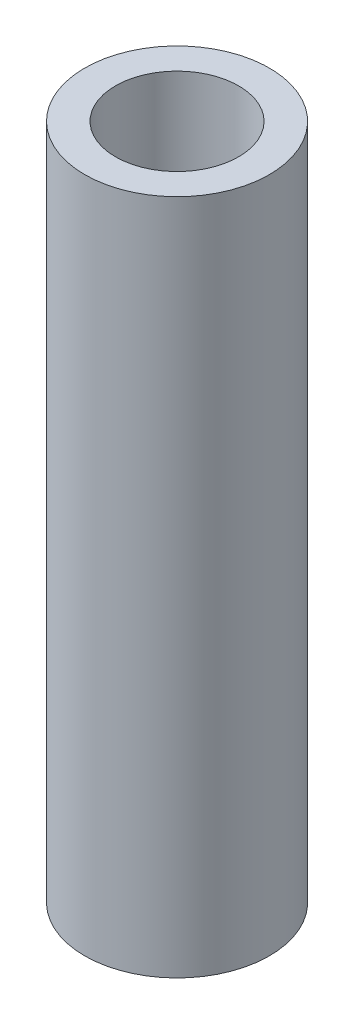
ISO-10303-21;
HEADER;
FILE_DESCRIPTION(('STEP AP214'),'2;1');
FILE_NAME('part.step','',(''),(''),'','','');
FILE_SCHEMA(('AUTOMOTIVE_DESIGN { 1 0 10303 214 1 1 1 1 }'));
ENDSEC;
DATA;
#1=APPLICATION_CONTEXT('core data for automotive mechanical design processes');
#2=APPLICATION_PROTOCOL_DEFINITION('international standard','automotive_design',2000,#1);
#3=PRODUCT_CONTEXT('',#1,'mechanical');
#4=PRODUCT('Part','Part','',(#3));
#5=PRODUCT_RELATED_PRODUCT_CATEGORY('part','',(#4));
#6=PRODUCT_DEFINITION_FORMATION('','',#4);
#7=PRODUCT_DEFINITION_CONTEXT('part definition',#1,'design');
#8=PRODUCT_DEFINITION('design','',#6,#7);
#9=PRODUCT_DEFINITION_SHAPE('','',#8);
#10=(LENGTH_UNIT() NAMED_UNIT(*) SI_UNIT(.MILLI.,.METRE.));
#11=(NAMED_UNIT(*) PLANE_ANGLE_UNIT() SI_UNIT($,.RADIAN.));
#12=(NAMED_UNIT(*) SI_UNIT($,.STERADIAN.) SOLID_ANGLE_UNIT());
#13=UNCERTAINTY_MEASURE_WITH_UNIT(LENGTH_MEASURE(1.E-05),#10,'distance_accuracy_value','');
#14=(GEOMETRIC_REPRESENTATION_CONTEXT(3) GLOBAL_UNCERTAINTY_ASSIGNED_CONTEXT((#13)) GLOBAL_UNIT_ASSIGNED_CONTEXT((#10,
#11,#12)) REPRESENTATION_CONTEXT('',''));
#15=CARTESIAN_POINT('',(0.,0.,0.));
#16=DIRECTION('',(0.,0.,1.));
#17=DIRECTION('',(1.,0.,0.));
#18=AXIS2_PLACEMENT_3D('',#15,#16,#17);
#19=CARTESIAN_POINT('',(0.,-47.0678520908019,0.));
#20=DIRECTION('',(0.,1.,0.));
#21=DIRECTION('',(0.,0.,1.));
#22=AXIS2_PLACEMENT_3D('',#19,#20,#21);
#23=CYLINDRICAL_SURFACE('',#22,2.38125);
#24=CARTESIAN_POINT('',(0.,-40.33266,0.));
#25=DIRECTION('',(0.,1.,0.));
#26=DIRECTION('',(0.,0.,1.));
#27=AXIS2_PLACEMENT_3D('',#24,#25,#26);
#28=CIRCLE('',#27,2.38125);
#29=CARTESIAN_POINT('',(0.,-40.33266,2.38125));
#30=VERTEX_POINT('',#29);
#31=EDGE_CURVE('E10',#30,#30,#28,.F.);
#32=ORIENTED_EDGE('',*,*,#31,.F.);
#33=EDGE_LOOP('',(#32));
#34=FACE_BOUND('',#33,.T.);
#35=CARTESIAN_POINT('',(0.,-22.882660102,0.));
#36=DIRECTION('',(0.,1.,0.));
#37=DIRECTION('',(0.,0.,1.));
#38=AXIS2_PLACEMENT_3D('',#35,#36,#37);
#39=CIRCLE('',#38,2.38125);
#40=CARTESIAN_POINT('',(0.,-22.882660102,2.38125));
#41=VERTEX_POINT('',#40);
#42=EDGE_CURVE('E45',#41,#41,#39,.T.);
#43=ORIENTED_EDGE('',*,*,#42,.F.);
#44=EDGE_LOOP('',(#43));
#45=FACE_BOUND('',#44,.T.);
#46=ADVANCED_FACE('F39',(#34,#45),#23,.T.);
#47=CARTESIAN_POINT('',(0.,-22.882660102,0.));
#48=DIRECTION('',(0.,1.,0.));
#49=DIRECTION('',(0.,0.,1.));
#50=AXIS2_PLACEMENT_3D('',#47,#48,#49);
#51=PLANE('',#50);
#52=CARTESIAN_POINT('',(0.,-22.882660102,0.));
#53=DIRECTION('',(0.,1.,0.));
#54=DIRECTION('',(0.,0.,1.));
#55=AXIS2_PLACEMENT_3D('',#52,#53,#54);
#56=CIRCLE('',#55,1.5875);
#57=CARTESIAN_POINT('',(0.,-22.882660102,1.5875));
#58=VERTEX_POINT('',#57);
#59=EDGE_CURVE('E53',#58,#58,#56,.T.);
#60=ORIENTED_EDGE('',*,*,#59,.F.);
#61=EDGE_LOOP('',(#60));
#62=FACE_BOUND('',#61,.T.);
#63=ORIENTED_EDGE('',*,*,#42,.T.);
#64=EDGE_LOOP('',(#63));
#65=FACE_BOUND('',#64,.T.);
#66=ADVANCED_FACE('F61',(#62,#65),#51,.T.);
#67=CARTESIAN_POINT('',(0.,-40.33266,0.));
#68=DIRECTION('',(0.,1.,0.));
#69=DIRECTION('',(0.,0.,1.));
#70=AXIS2_PLACEMENT_3D('',#67,#68,#69);
#71=PLANE('',#70);
#72=CARTESIAN_POINT('',(0.,-40.33266,0.));
#73=DIRECTION('',(0.,1.,0.));
#74=DIRECTION('',(0.,0.,1.));
#75=AXIS2_PLACEMENT_3D('',#72,#73,#74);
#76=CIRCLE('',#75,1.5875);
#77=CARTESIAN_POINT('',(0.,-40.33266,1.5875));
#78=VERTEX_POINT('',#77);
#79=EDGE_CURVE('E49',#78,#78,#76,.T.);
#80=ORIENTED_EDGE('',*,*,#79,.T.);
#81=EDGE_LOOP('',(#80));
#82=FACE_BOUND('',#81,.T.);
#83=ORIENTED_EDGE('',*,*,#31,.T.);
#84=EDGE_LOOP('',(#83));
#85=FACE_BOUND('',#84,.T.);
#86=ADVANCED_FACE('F63',(#82,#85),#71,.F.);
#87=CARTESIAN_POINT('',(0.,-22.882660102,0.));
#88=DIRECTION('',(0.,1.,0.));
#89=DIRECTION('',(0.,0.,1.));
#90=AXIS2_PLACEMENT_3D('',#87,#88,#89);
#91=CYLINDRICAL_SURFACE('',#90,1.5875);
#92=ORIENTED_EDGE('',*,*,#79,.F.);
#93=EDGE_LOOP('',(#92));
#94=FACE_BOUND('',#93,.T.);
#95=ORIENTED_EDGE('',*,*,#59,.T.);
#96=EDGE_LOOP('',(#95));
#97=FACE_BOUND('',#96,.T.);
#98=ADVANCED_FACE('F59',(#94,#97),#91,.F.);
#99=CLOSED_SHELL('',(#46,#66,#86,#98));
#100=MANIFOLD_SOLID_BREP('B2',#99);
#101=ADVANCED_BREP_SHAPE_REPRESENTATION('',(#18,#100),#14);
#102=SHAPE_DEFINITION_REPRESENTATION(#9,#101);
ENDSEC;
END-ISO-10303-21;
